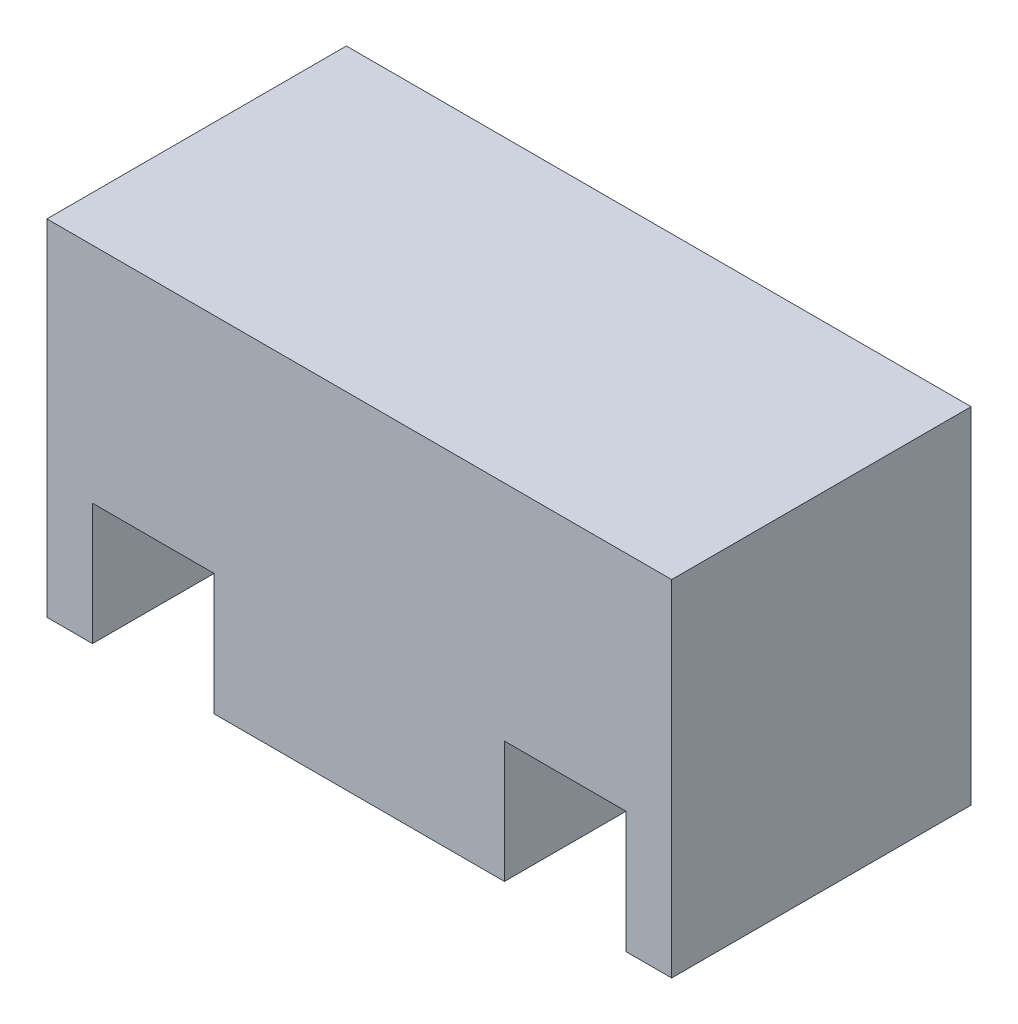
ISO-10303-21;
HEADER;
FILE_DESCRIPTION(('STEP AP214'),'2;1');
FILE_NAME('part.step','',(''),(''),'','','');
FILE_SCHEMA(('AUTOMOTIVE_DESIGN { 1 0 10303 214 1 1 1 1 }'));
ENDSEC;
DATA;
#1=APPLICATION_CONTEXT('core data for automotive mechanical design processes');
#2=APPLICATION_PROTOCOL_DEFINITION('international standard','automotive_design',2000,#1);
#3=PRODUCT_CONTEXT('',#1,'mechanical');
#4=PRODUCT('Part','Part','',(#3));
#5=PRODUCT_RELATED_PRODUCT_CATEGORY('part','',(#4));
#6=PRODUCT_DEFINITION_FORMATION('','',#4);
#7=PRODUCT_DEFINITION_CONTEXT('part definition',#1,'design');
#8=PRODUCT_DEFINITION('design','',#6,#7);
#9=PRODUCT_DEFINITION_SHAPE('','',#8);
#10=(LENGTH_UNIT() NAMED_UNIT(*) SI_UNIT(.MILLI.,.METRE.));
#11=(NAMED_UNIT(*) PLANE_ANGLE_UNIT() SI_UNIT($,.RADIAN.));
#12=(NAMED_UNIT(*) SI_UNIT($,.STERADIAN.) SOLID_ANGLE_UNIT());
#13=UNCERTAINTY_MEASURE_WITH_UNIT(LENGTH_MEASURE(1.E-05),#10,'distance_accuracy_value','');
#14=(GEOMETRIC_REPRESENTATION_CONTEXT(3) GLOBAL_UNCERTAINTY_ASSIGNED_CONTEXT((#13)) GLOBAL_UNIT_ASSIGNED_CONTEXT((#10,
#11,#12)) REPRESENTATION_CONTEXT('',''));
#15=CARTESIAN_POINT('',(0.,0.,0.));
#16=DIRECTION('',(0.,0.,1.));
#17=DIRECTION('',(1.,0.,0.));
#18=AXIS2_PLACEMENT_3D('',#15,#16,#17);
#19=CARTESIAN_POINT('',(-20.4164559898159,-9.48481026298535,19.7));
#20=DIRECTION('',(0.,1.,0.));
#21=DIRECTION('',(0.,0.,1.));
#22=AXIS2_PLACEMENT_3D('',#19,#20,#21);
#23=PLANE('',#22);
#24=DIRECTION('',(1.,0.,0.));
#25=VECTOR('',#24,1.);
#26=CARTESIAN_POINT('',(-20.4164559898159,-9.48481026298535,0.));
#27=LINE('',#26,#25);
#28=CARTESIAN_POINT('',(-20.4164559898159,-9.48481026298535,0.));
#29=VERTEX_POINT('',#28);
#30=CARTESIAN_POINT('',(-17.4164559898159,-9.48481026298535,0.));
#31=VERTEX_POINT('',#30);
#32=EDGE_CURVE('E137',#29,#31,#27,.T.);
#33=ORIENTED_EDGE('',*,*,#32,.T.);
#34=DIRECTION('',(0.,0.,1.));
#35=VECTOR('',#34,1.);
#36=CARTESIAN_POINT('',(-17.4164559898159,-9.48481026298535,0.));
#37=LINE('',#36,#35);
#38=CARTESIAN_POINT('',(-17.4164559898159,-9.48481026298535,19.7));
#39=VERTEX_POINT('',#38);
#40=EDGE_CURVE('E123',#31,#39,#37,.T.);
#41=ORIENTED_EDGE('',*,*,#40,.T.);
#42=DIRECTION('',(1.,0.,0.));
#43=VECTOR('',#42,1.);
#44=CARTESIAN_POINT('',(-20.4164559898159,-9.48481026298535,19.7));
#45=LINE('',#44,#43);
#46=CARTESIAN_POINT('',(-20.4164559898159,-9.48481026298535,19.7));
#47=VERTEX_POINT('',#46);
#48=EDGE_CURVE('E169',#47,#39,#45,.T.);
#49=ORIENTED_EDGE('',*,*,#48,.F.);
#50=DIRECTION('',(0.,0.,-1.));
#51=VECTOR('',#50,1.);
#52=CARTESIAN_POINT('',(-20.4164559898159,-9.48481026298535,19.7));
#53=LINE('',#52,#51);
#54=EDGE_CURVE('E11',#47,#29,#53,.T.);
#55=ORIENTED_EDGE('',*,*,#54,.T.);
#56=EDGE_LOOP('',(#33,#41,#49,#55));
#57=FACE_BOUND('',#56,.T.);
#58=ADVANCED_FACE('F34',(#57),#23,.F.);
#59=CARTESIAN_POINT('',(-9.41645598981592,-9.48481026298535,19.7));
#60=VERTEX_POINT('',#59);
#61=CARTESIAN_POINT('',(9.68354401018408,-9.48481026298535,19.7));
#62=VERTEX_POINT('',#61);
#63=EDGE_CURVE('E171',#60,#62,#45,.T.);
#64=ORIENTED_EDGE('',*,*,#63,.F.);
#65=DIRECTION('',(0.,0.,1.));
#66=VECTOR('',#65,1.);
#67=CARTESIAN_POINT('',(-9.41645598981592,-9.48481026298535,0.));
#68=LINE('',#67,#66);
#69=CARTESIAN_POINT('',(-9.41645598981592,-9.48481026298535,0.));
#70=VERTEX_POINT('',#69);
#71=EDGE_CURVE('E132',#70,#60,#68,.T.);
#72=ORIENTED_EDGE('',*,*,#71,.F.);
#73=CARTESIAN_POINT('',(9.68354401018408,-9.48481026298535,0.));
#74=VERTEX_POINT('',#73);
#75=EDGE_CURVE('E145',#70,#74,#27,.T.);
#76=ORIENTED_EDGE('',*,*,#75,.T.);
#77=DIRECTION('',(0.,0.,1.));
#78=VECTOR('',#77,1.);
#79=CARTESIAN_POINT('',(9.68354401018408,-9.48481026298535,0.));
#80=LINE('',#79,#78);
#81=EDGE_CURVE('E176',#74,#62,#80,.T.);
#82=ORIENTED_EDGE('',*,*,#81,.T.);
#83=EDGE_LOOP('',(#64,#72,#76,#82));
#84=FACE_BOUND('',#83,.T.);
#85=ADVANCED_FACE('F216',(#84),#23,.F.);
#86=CARTESIAN_POINT('',(-20.4164559898159,13.2151897370147,19.7));
#87=DIRECTION('',(1.,0.,0.));
#88=DIRECTION('',(0.,0.,-1.));
#89=AXIS2_PLACEMENT_3D('',#86,#87,#88);
#90=PLANE('',#89);
#91=DIRECTION('',(0.,-1.,0.));
#92=VECTOR('',#91,1.);
#93=CARTESIAN_POINT('',(-20.4164559898159,13.2151897370147,0.));
#94=LINE('',#93,#92);
#95=CARTESIAN_POINT('',(-20.4164559898159,13.2151897370147,0.));
#96=VERTEX_POINT('',#95);
#97=EDGE_CURVE('E152',#96,#29,#94,.T.);
#98=ORIENTED_EDGE('',*,*,#97,.T.);
#99=ORIENTED_EDGE('',*,*,#54,.F.);
#100=DIRECTION('',(0.,-1.,0.));
#101=VECTOR('',#100,1.);
#102=CARTESIAN_POINT('',(-20.4164559898159,13.2151897370147,19.7));
#103=LINE('',#102,#101);
#104=CARTESIAN_POINT('',(-20.4164559898159,13.2151897370147,19.7));
#105=VERTEX_POINT('',#104);
#106=EDGE_CURVE('E173',#105,#47,#103,.T.);
#107=ORIENTED_EDGE('',*,*,#106,.F.);
#108=DIRECTION('',(0.,0.,-1.));
#109=VECTOR('',#108,1.);
#110=CARTESIAN_POINT('',(-20.4164559898159,13.2151897370147,19.7));
#111=LINE('',#110,#109);
#112=EDGE_CURVE('E166',#105,#96,#111,.T.);
#113=ORIENTED_EDGE('',*,*,#112,.T.);
#114=EDGE_LOOP('',(#98,#99,#107,#113));
#115=FACE_BOUND('',#114,.T.);
#116=ADVANCED_FACE('F36',(#115),#90,.F.);
#117=CARTESIAN_POINT('',(17.6835440101841,-9.48481026298535,19.7));
#118=VERTEX_POINT('',#117);
#119=CARTESIAN_POINT('',(20.6835440101841,-9.48481026298535,19.7));
#120=VERTEX_POINT('',#119);
#121=EDGE_CURVE('E172',#118,#120,#45,.T.);
#122=ORIENTED_EDGE('',*,*,#121,.F.);
#123=DIRECTION('',(0.,0.,1.));
#124=VECTOR('',#123,1.);
#125=CARTESIAN_POINT('',(17.6835440101841,-9.48481026298535,0.));
#126=LINE('',#125,#124);
#127=CARTESIAN_POINT('',(17.6835440101841,-9.48481026298535,0.));
#128=VERTEX_POINT('',#127);
#129=EDGE_CURVE('E179',#128,#118,#126,.T.);
#130=ORIENTED_EDGE('',*,*,#129,.F.);
#131=CARTESIAN_POINT('',(20.6835440101841,-9.48481026298535,0.));
#132=VERTEX_POINT('',#131);
#133=EDGE_CURVE('E147',#128,#132,#27,.T.);
#134=ORIENTED_EDGE('',*,*,#133,.T.);
#135=DIRECTION('',(0.,0.,-1.));
#136=VECTOR('',#135,1.);
#137=CARTESIAN_POINT('',(20.6835440101841,-9.48481026298535,19.7));
#138=LINE('',#137,#136);
#139=EDGE_CURVE('E42',#120,#132,#138,.T.);
#140=ORIENTED_EDGE('',*,*,#139,.F.);
#141=EDGE_LOOP('',(#122,#130,#134,#140));
#142=FACE_BOUND('',#141,.T.);
#143=ADVANCED_FACE('F226',(#142),#23,.F.);
#144=CARTESIAN_POINT('',(20.6835440101841,13.2151897370147,19.7));
#145=DIRECTION('',(-1.,0.,0.));
#146=DIRECTION('',(0.,-1.,0.));
#147=AXIS2_PLACEMENT_3D('',#144,#145,#146);
#148=PLANE('',#147);
#149=DIRECTION('',(0.,1.,0.));
#150=VECTOR('',#149,1.);
#151=CARTESIAN_POINT('',(20.6835440101841,13.2151897370147,0.));
#152=LINE('',#151,#150);
#153=CARTESIAN_POINT('',(20.6835440101841,13.2151897370147,0.));
#154=VERTEX_POINT('',#153);
#155=EDGE_CURVE('E144',#132,#154,#152,.T.);
#156=ORIENTED_EDGE('',*,*,#155,.T.);
#157=DIRECTION('',(0.,0.,-1.));
#158=VECTOR('',#157,1.);
#159=CARTESIAN_POINT('',(20.6835440101841,13.2151897370147,19.7));
#160=LINE('',#159,#158);
#161=CARTESIAN_POINT('',(20.6835440101841,13.2151897370147,19.7));
#162=VERTEX_POINT('',#161);
#163=EDGE_CURVE('E229',#162,#154,#160,.T.);
#164=ORIENTED_EDGE('',*,*,#163,.F.);
#165=DIRECTION('',(0.,1.,0.));
#166=VECTOR('',#165,1.);
#167=CARTESIAN_POINT('',(20.6835440101841,13.2151897370147,19.7));
#168=LINE('',#167,#166);
#169=EDGE_CURVE('E167',#120,#162,#168,.T.);
#170=ORIENTED_EDGE('',*,*,#169,.F.);
#171=ORIENTED_EDGE('',*,*,#139,.T.);
#172=EDGE_LOOP('',(#156,#164,#170,#171));
#173=FACE_BOUND('',#172,.T.);
#174=ADVANCED_FACE('F230',(#173),#148,.F.);
#175=CARTESIAN_POINT('',(-20.4164559898159,13.2151897370147,19.7));
#176=DIRECTION('',(0.,-1.,0.));
#177=DIRECTION('',(0.,0.,-1.));
#178=AXIS2_PLACEMENT_3D('',#175,#176,#177);
#179=PLANE('',#178);
#180=DIRECTION('',(-1.,0.,0.));
#181=VECTOR('',#180,1.);
#182=CARTESIAN_POINT('',(-20.4164559898159,13.2151897370147,0.));
#183=LINE('',#182,#181);
#184=EDGE_CURVE('E148',#154,#96,#183,.T.);
#185=ORIENTED_EDGE('',*,*,#184,.T.);
#186=ORIENTED_EDGE('',*,*,#112,.F.);
#187=DIRECTION('',(-1.,0.,0.));
#188=VECTOR('',#187,1.);
#189=CARTESIAN_POINT('',(-20.4164559898159,13.2151897370147,19.7));
#190=LINE('',#189,#188);
#191=EDGE_CURVE('E164',#162,#105,#190,.T.);
#192=ORIENTED_EDGE('',*,*,#191,.F.);
#193=ORIENTED_EDGE('',*,*,#163,.T.);
#194=EDGE_LOOP('',(#185,#186,#192,#193));
#195=FACE_BOUND('',#194,.T.);
#196=ADVANCED_FACE('F237',(#195),#179,.F.);
#197=CARTESIAN_POINT('',(0.,0.,19.7));
#198=DIRECTION('',(0.,0.,1.));
#199=DIRECTION('',(1.,0.,0.));
#200=AXIS2_PLACEMENT_3D('',#197,#198,#199);
#201=PLANE('',#200);
#202=DIRECTION('',(0.,-1.,0.));
#203=VECTOR('',#202,1.);
#204=CARTESIAN_POINT('',(-17.4164559898159,-9.48481026298535,19.7));
#205=LINE('',#204,#203);
#206=CARTESIAN_POINT('',(-17.4164559898159,-1.48481026298535,19.7));
#207=VERTEX_POINT('',#206);
#208=EDGE_CURVE('E128',#207,#39,#205,.T.);
#209=ORIENTED_EDGE('',*,*,#208,.F.);
#210=DIRECTION('',(-1.,0.,0.));
#211=VECTOR('',#210,1.);
#212=CARTESIAN_POINT('',(-17.4164559898159,-1.48481026298535,19.7));
#213=LINE('',#212,#211);
#214=CARTESIAN_POINT('',(-9.41645598981592,-1.48481026298535,19.7));
#215=VERTEX_POINT('',#214);
#216=EDGE_CURVE('E140',#215,#207,#213,.T.);
#217=ORIENTED_EDGE('',*,*,#216,.F.);
#218=DIRECTION('',(0.,1.,0.));
#219=VECTOR('',#218,1.);
#220=CARTESIAN_POINT('',(-9.41645598981592,-9.48481026298535,19.7));
#221=LINE('',#220,#219);
#222=EDGE_CURVE('E204',#60,#215,#221,.T.);
#223=ORIENTED_EDGE('',*,*,#222,.F.);
#224=ORIENTED_EDGE('',*,*,#63,.T.);
#225=DIRECTION('',(0.,-1.,0.));
#226=VECTOR('',#225,1.);
#227=CARTESIAN_POINT('',(9.68354401018408,-9.48481026298535,19.7));
#228=LINE('',#227,#226);
#229=CARTESIAN_POINT('',(9.68354401018408,-1.48481026298535,19.7));
#230=VERTEX_POINT('',#229);
#231=EDGE_CURVE('E192',#230,#62,#228,.T.);
#232=ORIENTED_EDGE('',*,*,#231,.F.);
#233=DIRECTION('',(-1.,0.,0.));
#234=VECTOR('',#233,1.);
#235=CARTESIAN_POINT('',(9.68354401018408,-1.48481026298535,19.7));
#236=LINE('',#235,#234);
#237=CARTESIAN_POINT('',(17.6835440101841,-1.48481026298535,19.7));
#238=VERTEX_POINT('',#237);
#239=EDGE_CURVE('E185',#238,#230,#236,.T.);
#240=ORIENTED_EDGE('',*,*,#239,.F.);
#241=DIRECTION('',(0.,1.,0.));
#242=VECTOR('',#241,1.);
#243=CARTESIAN_POINT('',(17.6835440101841,-9.48481026298535,19.7));
#244=LINE('',#243,#242);
#245=EDGE_CURVE('E189',#118,#238,#244,.T.);
#246=ORIENTED_EDGE('',*,*,#245,.F.);
#247=ORIENTED_EDGE('',*,*,#121,.T.);
#248=ORIENTED_EDGE('',*,*,#169,.T.);
#249=ORIENTED_EDGE('',*,*,#191,.T.);
#250=ORIENTED_EDGE('',*,*,#106,.T.);
#251=ORIENTED_EDGE('',*,*,#48,.T.);
#252=EDGE_LOOP('',(#209,#217,#223,#224,#232,#240,#246,#247,#248,#249,#250,#251));
#253=FACE_BOUND('',#252,.T.);
#254=ADVANCED_FACE('F222',(#253),#201,.T.);
#255=CARTESIAN_POINT('',(0.,0.,0.));
#256=DIRECTION('',(0.,0.,1.));
#257=DIRECTION('',(1.,0.,0.));
#258=AXIS2_PLACEMENT_3D('',#255,#256,#257);
#259=PLANE('',#258);
#260=DIRECTION('',(-1.,0.,0.));
#261=VECTOR('',#260,1.);
#262=CARTESIAN_POINT('',(-17.4164559898159,-1.48481026298535,0.));
#263=LINE('',#262,#261);
#264=CARTESIAN_POINT('',(-9.41645598981592,-1.48481026298535,0.));
#265=VERTEX_POINT('',#264);
#266=CARTESIAN_POINT('',(-17.4164559898159,-1.48481026298535,0.));
#267=VERTEX_POINT('',#266);
#268=EDGE_CURVE('E49',#265,#267,#263,.T.);
#269=ORIENTED_EDGE('',*,*,#268,.T.);
#270=DIRECTION('',(0.,-1.,0.));
#271=VECTOR('',#270,1.);
#272=CARTESIAN_POINT('',(-17.4164559898159,-9.48481026298535,0.));
#273=LINE('',#272,#271);
#274=EDGE_CURVE('E126',#267,#31,#273,.T.);
#275=ORIENTED_EDGE('',*,*,#274,.T.);
#276=ORIENTED_EDGE('',*,*,#32,.F.);
#277=ORIENTED_EDGE('',*,*,#97,.F.);
#278=ORIENTED_EDGE('',*,*,#184,.F.);
#279=ORIENTED_EDGE('',*,*,#155,.F.);
#280=ORIENTED_EDGE('',*,*,#133,.F.);
#281=DIRECTION('',(0.,1.,0.));
#282=VECTOR('',#281,1.);
#283=CARTESIAN_POINT('',(17.6835440101841,-9.48481026298535,0.));
#284=LINE('',#283,#282);
#285=CARTESIAN_POINT('',(17.6835440101841,-1.48481026298535,0.));
#286=VERTEX_POINT('',#285);
#287=EDGE_CURVE('E195',#128,#286,#284,.T.);
#288=ORIENTED_EDGE('',*,*,#287,.T.);
#289=DIRECTION('',(-1.,0.,0.));
#290=VECTOR('',#289,1.);
#291=CARTESIAN_POINT('',(9.68354401018408,-1.48481026298535,0.));
#292=LINE('',#291,#290);
#293=CARTESIAN_POINT('',(9.68354401018408,-1.48481026298535,0.));
#294=VERTEX_POINT('',#293);
#295=EDGE_CURVE('E57',#286,#294,#292,.T.);
#296=ORIENTED_EDGE('',*,*,#295,.T.);
#297=DIRECTION('',(0.,-1.,0.));
#298=VECTOR('',#297,1.);
#299=CARTESIAN_POINT('',(9.68354401018408,-9.48481026298535,0.));
#300=LINE('',#299,#298);
#301=EDGE_CURVE('E188',#294,#74,#300,.T.);
#302=ORIENTED_EDGE('',*,*,#301,.T.);
#303=ORIENTED_EDGE('',*,*,#75,.F.);
#304=DIRECTION('',(0.,1.,0.));
#305=VECTOR('',#304,1.);
#306=CARTESIAN_POINT('',(-9.41645598981592,-9.48481026298535,0.));
#307=LINE('',#306,#305);
#308=EDGE_CURVE('E139',#70,#265,#307,.T.);
#309=ORIENTED_EDGE('',*,*,#308,.T.);
#310=EDGE_LOOP('',(#269,#275,#276,#277,#278,#279,#280,#288,#296,#302,#303,#309));
#311=FACE_BOUND('',#310,.T.);
#312=ADVANCED_FACE('F135',(#311),#259,.F.);
#313=CARTESIAN_POINT('',(9.68354401018408,-9.48481026298535,0.));
#314=DIRECTION('',(-1.,0.,0.));
#315=DIRECTION('',(0.,0.,1.));
#316=AXIS2_PLACEMENT_3D('',#313,#314,#315);
#317=PLANE('',#316);
#318=ORIENTED_EDGE('',*,*,#231,.T.);
#319=ORIENTED_EDGE('',*,*,#81,.F.);
#320=ORIENTED_EDGE('',*,*,#301,.F.);
#321=DIRECTION('',(0.,0.,1.));
#322=VECTOR('',#321,1.);
#323=CARTESIAN_POINT('',(9.68354401018408,-1.48481026298535,0.));
#324=LINE('',#323,#322);
#325=EDGE_CURVE('E183',#294,#230,#324,.T.);
#326=ORIENTED_EDGE('',*,*,#325,.T.);
#327=EDGE_LOOP('',(#318,#319,#320,#326));
#328=FACE_BOUND('',#327,.T.);
#329=ADVANCED_FACE('F254',(#328),#317,.F.);
#330=CARTESIAN_POINT('',(9.68354401018408,-1.48481026298535,0.));
#331=DIRECTION('',(0.,1.,0.));
#332=DIRECTION('',(0.,0.,1.));
#333=AXIS2_PLACEMENT_3D('',#330,#331,#332);
#334=PLANE('',#333);
#335=ORIENTED_EDGE('',*,*,#239,.T.);
#336=ORIENTED_EDGE('',*,*,#325,.F.);
#337=ORIENTED_EDGE('',*,*,#295,.F.);
#338=DIRECTION('',(0.,0.,1.));
#339=VECTOR('',#338,1.);
#340=CARTESIAN_POINT('',(17.6835440101841,-1.48481026298535,0.));
#341=LINE('',#340,#339);
#342=EDGE_CURVE('E181',#286,#238,#341,.T.);
#343=ORIENTED_EDGE('',*,*,#342,.T.);
#344=EDGE_LOOP('',(#335,#336,#337,#343));
#345=FACE_BOUND('',#344,.T.);
#346=ADVANCED_FACE('F259',(#345),#334,.F.);
#347=CARTESIAN_POINT('',(17.6835440101841,-9.48481026298535,0.));
#348=DIRECTION('',(1.,0.,0.));
#349=DIRECTION('',(0.,0.,-1.));
#350=AXIS2_PLACEMENT_3D('',#347,#348,#349);
#351=PLANE('',#350);
#352=ORIENTED_EDGE('',*,*,#245,.T.);
#353=ORIENTED_EDGE('',*,*,#342,.F.);
#354=ORIENTED_EDGE('',*,*,#287,.F.);
#355=ORIENTED_EDGE('',*,*,#129,.T.);
#356=EDGE_LOOP('',(#352,#353,#354,#355));
#357=FACE_BOUND('',#356,.T.);
#358=ADVANCED_FACE('F261',(#357),#351,.F.);
#359=CARTESIAN_POINT('',(-17.4164559898159,-9.48481026298535,0.));
#360=DIRECTION('',(-1.,0.,0.));
#361=DIRECTION('',(0.,0.,1.));
#362=AXIS2_PLACEMENT_3D('',#359,#360,#361);
#363=PLANE('',#362);
#364=ORIENTED_EDGE('',*,*,#208,.T.);
#365=ORIENTED_EDGE('',*,*,#40,.F.);
#366=ORIENTED_EDGE('',*,*,#274,.F.);
#367=DIRECTION('',(0.,0.,1.));
#368=VECTOR('',#367,1.);
#369=CARTESIAN_POINT('',(-17.4164559898159,-1.48481026298535,0.));
#370=LINE('',#369,#368);
#371=EDGE_CURVE('E158',#267,#207,#370,.T.);
#372=ORIENTED_EDGE('',*,*,#371,.T.);
#373=EDGE_LOOP('',(#364,#365,#366,#372));
#374=FACE_BOUND('',#373,.T.);
#375=ADVANCED_FACE('F125',(#374),#363,.F.);
#376=CARTESIAN_POINT('',(-17.4164559898159,-1.48481026298535,0.));
#377=DIRECTION('',(0.,1.,0.));
#378=DIRECTION('',(0.,0.,1.));
#379=AXIS2_PLACEMENT_3D('',#376,#377,#378);
#380=PLANE('',#379);
#381=ORIENTED_EDGE('',*,*,#216,.T.);
#382=ORIENTED_EDGE('',*,*,#371,.F.);
#383=ORIENTED_EDGE('',*,*,#268,.F.);
#384=DIRECTION('',(0.,0.,1.));
#385=VECTOR('',#384,1.);
#386=CARTESIAN_POINT('',(-9.41645598981592,-1.48481026298535,0.));
#387=LINE('',#386,#385);
#388=EDGE_CURVE('E161',#265,#215,#387,.T.);
#389=ORIENTED_EDGE('',*,*,#388,.T.);
#390=EDGE_LOOP('',(#381,#382,#383,#389));
#391=FACE_BOUND('',#390,.T.);
#392=ADVANCED_FACE('F269',(#391),#380,.F.);
#393=CARTESIAN_POINT('',(-9.41645598981592,-9.48481026298535,0.));
#394=DIRECTION('',(1.,0.,0.));
#395=DIRECTION('',(0.,0.,-1.));
#396=AXIS2_PLACEMENT_3D('',#393,#394,#395);
#397=PLANE('',#396);
#398=ORIENTED_EDGE('',*,*,#222,.T.);
#399=ORIENTED_EDGE('',*,*,#388,.F.);
#400=ORIENTED_EDGE('',*,*,#308,.F.);
#401=ORIENTED_EDGE('',*,*,#71,.T.);
#402=EDGE_LOOP('',(#398,#399,#400,#401));
#403=FACE_BOUND('',#402,.T.);
#404=ADVANCED_FACE('F212',(#403),#397,.F.);
#405=CLOSED_SHELL('',(#58,#85,#116,#143,#174,#196,#254,#312,#329,#346,#358,#375,#392,#404));
#406=MANIFOLD_SOLID_BREP('B2',#405);
#407=ADVANCED_BREP_SHAPE_REPRESENTATION('',(#18,#406),#14);
#408=SHAPE_DEFINITION_REPRESENTATION(#9,#407);
ENDSEC;
END-ISO-10303-21;
